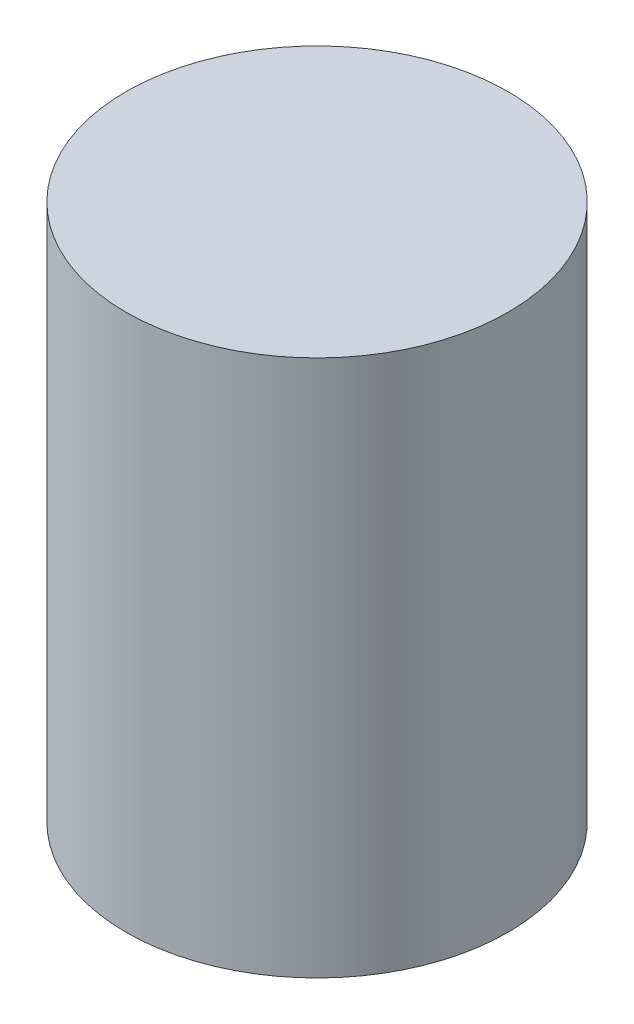
ISO-10303-21;
HEADER;
FILE_DESCRIPTION(('STEP AP214'),'2;1');
FILE_NAME('part.step','',(''),(''),'','','');
FILE_SCHEMA(('AUTOMOTIVE_DESIGN { 1 0 10303 214 1 1 1 1 }'));
ENDSEC;
DATA;
#1=APPLICATION_CONTEXT('core data for automotive mechanical design processes');
#2=APPLICATION_PROTOCOL_DEFINITION('international standard','automotive_design',2000,#1);
#3=PRODUCT_CONTEXT('',#1,'mechanical');
#4=PRODUCT('Part','Part','',(#3));
#5=PRODUCT_RELATED_PRODUCT_CATEGORY('part','',(#4));
#6=PRODUCT_DEFINITION_FORMATION('','',#4);
#7=PRODUCT_DEFINITION_CONTEXT('part definition',#1,'design');
#8=PRODUCT_DEFINITION('design','',#6,#7);
#9=PRODUCT_DEFINITION_SHAPE('','',#8);
#10=(LENGTH_UNIT() NAMED_UNIT(*) SI_UNIT(.MILLI.,.METRE.));
#11=(NAMED_UNIT(*) PLANE_ANGLE_UNIT() SI_UNIT($,.RADIAN.));
#12=(NAMED_UNIT(*) SI_UNIT($,.STERADIAN.) SOLID_ANGLE_UNIT());
#13=UNCERTAINTY_MEASURE_WITH_UNIT(LENGTH_MEASURE(1.E-05),#10,'distance_accuracy_value','');
#14=(GEOMETRIC_REPRESENTATION_CONTEXT(3) GLOBAL_UNCERTAINTY_ASSIGNED_CONTEXT((#13)) GLOBAL_UNIT_ASSIGNED_CONTEXT((#10,
#11,#12)) REPRESENTATION_CONTEXT('',''));
#15=CARTESIAN_POINT('',(0.,0.,0.));
#16=DIRECTION('',(0.,0.,1.));
#17=DIRECTION('',(1.,0.,0.));
#18=AXIS2_PLACEMENT_3D('',#15,#16,#17);
#19=CARTESIAN_POINT('',(0.,5.4102,45.445));
#20=DIRECTION('',(0.,-1.,0.));
#21=DIRECTION('',(0.,0.,-1.));
#22=AXIS2_PLACEMENT_3D('',#19,#20,#21);
#23=CYLINDRICAL_SURFACE('',#22,1.925);
#24=CARTESIAN_POINT('',(0.,5.4102,45.445));
#25=DIRECTION('',(0.,1.,0.));
#26=DIRECTION('',(0.,0.,1.));
#27=AXIS2_PLACEMENT_3D('',#24,#25,#26);
#28=CIRCLE('',#27,1.925);
#29=CARTESIAN_POINT('',(0.,5.4102,47.37));
#30=VERTEX_POINT('',#29);
#31=EDGE_CURVE('E10',#30,#30,#28,.T.);
#32=ORIENTED_EDGE('',*,*,#31,.F.);
#33=EDGE_LOOP('',(#32));
#34=FACE_BOUND('',#33,.T.);
#35=CARTESIAN_POINT('',(0.,0.,45.445));
#36=DIRECTION('',(0.,1.,0.));
#37=DIRECTION('',(0.,0.,1.));
#38=AXIS2_PLACEMENT_3D('',#35,#36,#37);
#39=CIRCLE('',#38,1.925);
#40=CARTESIAN_POINT('',(0.,0.,47.37));
#41=VERTEX_POINT('',#40);
#42=EDGE_CURVE('E36',#41,#41,#39,.T.);
#43=ORIENTED_EDGE('',*,*,#42,.T.);
#44=EDGE_LOOP('',(#43));
#45=FACE_BOUND('',#44,.T.);
#46=ADVANCED_FACE('F33',(#34,#45),#23,.T.);
#47=CARTESIAN_POINT('',(0.,5.4102,45.445));
#48=DIRECTION('',(0.,1.,0.));
#49=DIRECTION('',(0.,0.,1.));
#50=AXIS2_PLACEMENT_3D('',#47,#48,#49);
#51=PLANE('',#50);
#52=ORIENTED_EDGE('',*,*,#31,.T.);
#53=EDGE_LOOP('',(#52));
#54=FACE_BOUND('',#53,.T.);
#55=ADVANCED_FACE('F48',(#54),#51,.T.);
#56=CARTESIAN_POINT('',(0.,0.,45.445));
#57=DIRECTION('',(0.,1.,0.));
#58=DIRECTION('',(0.,0.,1.));
#59=AXIS2_PLACEMENT_3D('',#56,#57,#58);
#60=PLANE('',#59);
#61=ORIENTED_EDGE('',*,*,#42,.F.);
#62=EDGE_LOOP('',(#61));
#63=FACE_BOUND('',#62,.T.);
#64=ADVANCED_FACE('F46',(#63),#60,.F.);
#65=CLOSED_SHELL('',(#46,#55,#64));
#66=MANIFOLD_SOLID_BREP('B2',#65);
#67=ADVANCED_BREP_SHAPE_REPRESENTATION('',(#18,#66),#14);
#68=SHAPE_DEFINITION_REPRESENTATION(#9,#67);
ENDSEC;
END-ISO-10303-21;
